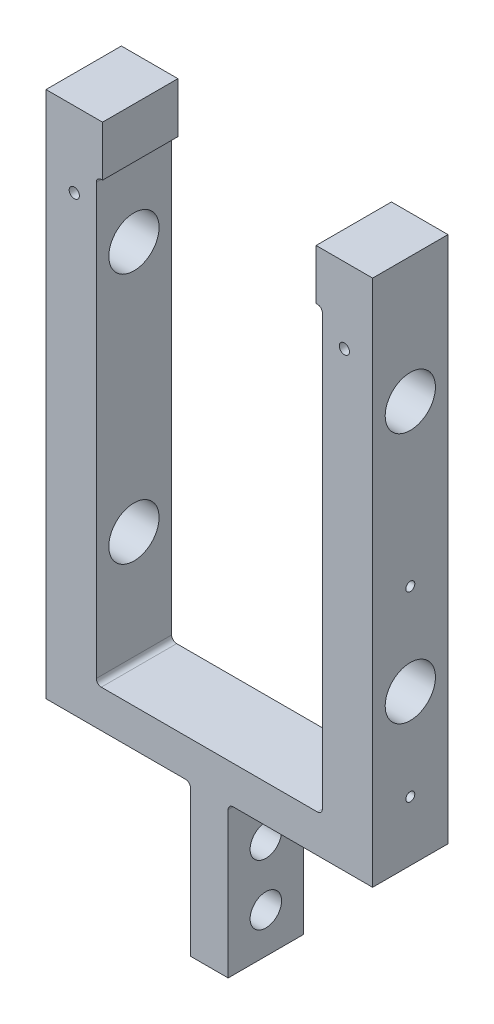
ISO-10303-21;
HEADER;
FILE_DESCRIPTION(('STEP AP214'),'2;1');
FILE_NAME('part.step','',(''),(''),'','','');
FILE_SCHEMA(('AUTOMOTIVE_DESIGN { 1 0 10303 214 1 1 1 1 }'));
ENDSEC;
DATA;
#1=APPLICATION_CONTEXT('core data for automotive mechanical design processes');
#2=APPLICATION_PROTOCOL_DEFINITION('international standard','automotive_design',2000,#1);
#3=PRODUCT_CONTEXT('',#1,'mechanical');
#4=PRODUCT('Part','Part','',(#3));
#5=PRODUCT_RELATED_PRODUCT_CATEGORY('part','',(#4));
#6=PRODUCT_DEFINITION_FORMATION('','',#4);
#7=PRODUCT_DEFINITION_CONTEXT('part definition',#1,'design');
#8=PRODUCT_DEFINITION('design','',#6,#7);
#9=PRODUCT_DEFINITION_SHAPE('','',#8);
#10=(LENGTH_UNIT() NAMED_UNIT(*) SI_UNIT(.MILLI.,.METRE.));
#11=(NAMED_UNIT(*) PLANE_ANGLE_UNIT() SI_UNIT($,.RADIAN.));
#12=(NAMED_UNIT(*) SI_UNIT($,.STERADIAN.) SOLID_ANGLE_UNIT());
#13=UNCERTAINTY_MEASURE_WITH_UNIT(LENGTH_MEASURE(1.E-05),#10,'distance_accuracy_value','');
#14=(GEOMETRIC_REPRESENTATION_CONTEXT(3) GLOBAL_UNCERTAINTY_ASSIGNED_CONTEXT((#13)) GLOBAL_UNIT_ASSIGNED_CONTEXT((#10,
#11,#12)) REPRESENTATION_CONTEXT('',''));
#15=CARTESIAN_POINT('',(0.,0.,0.));
#16=DIRECTION('',(0.,0.,1.));
#17=DIRECTION('',(1.,0.,0.));
#18=AXIS2_PLACEMENT_3D('',#15,#16,#17);
#19=CARTESIAN_POINT('',(41.275,152.4,9.52500000000001));
#20=DIRECTION('',(0.,-1.,0.));
#21=DIRECTION('',(0.,0.,-1.));
#22=AXIS2_PLACEMENT_3D('',#19,#20,#21);
#23=PLANE('',#22);
#24=DIRECTION('',(-1.,0.,0.));
#25=VECTOR('',#24,1.);
#26=CARTESIAN_POINT('',(41.275,152.4,-9.52500000000001));
#27=LINE('',#26,#25);
#28=CARTESIAN_POINT('',(41.275,152.4,-9.52500000000001));
#29=VERTEX_POINT('',#28);
#30=CARTESIAN_POINT('',(26.9875,152.4,-9.52500000000001));
#31=VERTEX_POINT('',#30);
#32=EDGE_CURVE('E275',#29,#31,#27,.T.);
#33=ORIENTED_EDGE('',*,*,#32,.T.);
#34=DIRECTION('',(0.,0.,1.));
#35=VECTOR('',#34,1.);
#36=CARTESIAN_POINT('',(26.9875,152.4,-9.52500000000001));
#37=LINE('',#36,#35);
#38=CARTESIAN_POINT('',(26.9875,152.4,9.52500000000001));
#39=VERTEX_POINT('',#38);
#40=EDGE_CURVE('E258',#31,#39,#37,.T.);
#41=ORIENTED_EDGE('',*,*,#40,.T.);
#42=DIRECTION('',(-1.,0.,0.));
#43=VECTOR('',#42,1.);
#44=CARTESIAN_POINT('',(41.275,152.4,9.52500000000001));
#45=LINE('',#44,#43);
#46=CARTESIAN_POINT('',(41.275,152.4,9.52500000000001));
#47=VERTEX_POINT('',#46);
#48=EDGE_CURVE('E467',#47,#39,#45,.T.);
#49=ORIENTED_EDGE('',*,*,#48,.F.);
#50=DIRECTION('',(0.,0.,-1.));
#51=VECTOR('',#50,1.);
#52=CARTESIAN_POINT('',(41.275,152.4,9.52500000000001));
#53=LINE('',#52,#51);
#54=EDGE_CURVE('E282',#47,#29,#53,.T.);
#55=ORIENTED_EDGE('',*,*,#54,.T.);
#56=EDGE_LOOP('',(#33,#41,#49,#55));
#57=FACE_BOUND('',#56,.T.);
#58=ADVANCED_FACE('F98',(#57),#23,.F.);
#59=CARTESIAN_POINT('',(28.575,139.7,9.52500000000001));
#60=DIRECTION('',(0.,-1.,0.));
#61=DIRECTION('',(0.,0.,-1.));
#62=AXIS2_PLACEMENT_3D('',#59,#60,#61);
#63=PLANE('',#62);
#64=DIRECTION('',(0.,0.,1.));
#65=VECTOR('',#64,1.);
#66=CARTESIAN_POINT('',(26.9875,139.7,-9.52500000000001));
#67=LINE('',#66,#65);
#68=CARTESIAN_POINT('',(26.9875,139.7,-9.52500000000001));
#69=VERTEX_POINT('',#68);
#70=CARTESIAN_POINT('',(26.9875,139.7,9.52500000000001));
#71=VERTEX_POINT('',#70);
#72=EDGE_CURVE('E515',#69,#71,#67,.T.);
#73=ORIENTED_EDGE('',*,*,#72,.F.);
#74=DIRECTION('',(-1.,0.,0.));
#75=VECTOR('',#74,1.);
#76=CARTESIAN_POINT('',(28.575,139.7,-9.52500000000001));
#77=LINE('',#76,#75);
#78=CARTESIAN_POINT('',(27.305,139.7,-9.52500000000001));
#79=VERTEX_POINT('',#78);
#80=EDGE_CURVE('E277',#79,#69,#77,.T.);
#81=ORIENTED_EDGE('',*,*,#80,.F.);
#82=DIRECTION('',(0.,0.,-1.));
#83=VECTOR('',#82,1.);
#84=CARTESIAN_POINT('',(27.305,139.7,9.52500000000001));
#85=LINE('',#84,#83);
#86=CARTESIAN_POINT('',(27.305,139.7,9.52500000000001));
#87=VERTEX_POINT('',#86);
#88=EDGE_CURVE('E374',#79,#87,#85,.F.);
#89=ORIENTED_EDGE('',*,*,#88,.T.);
#90=DIRECTION('',(-1.,0.,0.));
#91=VECTOR('',#90,1.);
#92=CARTESIAN_POINT('',(28.575,139.7,9.52500000000001));
#93=LINE('',#92,#91);
#94=EDGE_CURVE('E436',#87,#71,#93,.T.);
#95=ORIENTED_EDGE('',*,*,#94,.T.);
#96=EDGE_LOOP('',(#73,#81,#89,#95));
#97=FACE_BOUND('',#96,.T.);
#98=ADVANCED_FACE('F514',(#97),#63,.T.);
#99=CARTESIAN_POINT('',(41.275,131.596658993696,9.52500000000001));
#100=DIRECTION('',(-1.,0.,0.));
#101=DIRECTION('',(0.,-1.,0.));
#102=AXIS2_PLACEMENT_3D('',#99,#100,#101);
#103=PLANE('',#102);
#104=CARTESIAN_POINT('',(41.275,80.1624,0.));
#105=DIRECTION('',(1.,0.,0.));
#106=DIRECTION('',(0.,0.,-1.));
#107=AXIS2_PLACEMENT_3D('',#104,#105,#106);
#108=CIRCLE('',#107,1.13029999999999);
#109=CARTESIAN_POINT('',(41.275,80.1624,-1.1303));
#110=VERTEX_POINT('',#109);
#111=EDGE_CURVE('E702',#110,#110,#108,.T.);
#112=ORIENTED_EDGE('',*,*,#111,.F.);
#113=EDGE_LOOP('',(#112));
#114=FACE_BOUND('',#113,.T.);
#115=CARTESIAN_POINT('',(41.275,57.15,0.));
#116=DIRECTION('',(-1.,0.,0.));
#117=DIRECTION('',(0.,-1.,0.));
#118=AXIS2_PLACEMENT_3D('',#115,#116,#117);
#119=CIRCLE('',#118,6.34999999999673);
#120=CARTESIAN_POINT('',(41.275,50.8000000000033,0.));
#121=VERTEX_POINT('',#120);
#122=EDGE_CURVE('E324',#121,#121,#119,.T.);
#123=ORIENTED_EDGE('',*,*,#122,.T.);
#124=EDGE_LOOP('',(#123));
#125=FACE_BOUND('',#124,.T.);
#126=CARTESIAN_POINT('',(41.275,120.65,0.));
#127=DIRECTION('',(-1.,0.,0.));
#128=DIRECTION('',(0.,-1.,0.));
#129=AXIS2_PLACEMENT_3D('',#126,#127,#128);
#130=CIRCLE('',#129,6.34999999999999);
#131=CARTESIAN_POINT('',(41.275,114.3,0.));
#132=VERTEX_POINT('',#131);
#133=EDGE_CURVE('E628',#132,#132,#130,.T.);
#134=ORIENTED_EDGE('',*,*,#133,.T.);
#135=EDGE_LOOP('',(#134));
#136=FACE_BOUND('',#135,.T.);
#137=DIRECTION('',(0.,1.,0.));
#138=VECTOR('',#137,1.);
#139=CARTESIAN_POINT('',(41.275,131.596658993696,-9.52500000000001));
#140=LINE('',#139,#138);
#141=CARTESIAN_POINT('',(41.275,19.05,-9.52500000000001));
#142=VERTEX_POINT('',#141);
#143=EDGE_CURVE('E292',#142,#29,#140,.T.);
#144=ORIENTED_EDGE('',*,*,#143,.T.);
#145=ORIENTED_EDGE('',*,*,#54,.F.);
#146=DIRECTION('',(0.,1.,0.));
#147=VECTOR('',#146,1.);
#148=CARTESIAN_POINT('',(41.275,19.05,9.52500000000001));
#149=LINE('',#148,#147);
#150=CARTESIAN_POINT('',(41.275,19.05,9.52500000000001));
#151=VERTEX_POINT('',#150);
#152=EDGE_CURVE('E463',#151,#47,#149,.T.);
#153=ORIENTED_EDGE('',*,*,#152,.F.);
#154=DIRECTION('',(0.,0.,-1.));
#155=VECTOR('',#154,1.);
#156=CARTESIAN_POINT('',(41.275,19.05,9.52500000000001));
#157=LINE('',#156,#155);
#158=EDGE_CURVE('E314',#151,#142,#157,.T.);
#159=ORIENTED_EDGE('',*,*,#158,.T.);
#160=EDGE_LOOP('',(#144,#145,#153,#159));
#161=FACE_BOUND('',#160,.T.);
#162=CARTESIAN_POINT('',(41.275,34.1376,0.));
#163=DIRECTION('',(1.,0.,0.));
#164=DIRECTION('',(0.,0.,-1.));
#165=AXIS2_PLACEMENT_3D('',#162,#163,#164);
#166=CIRCLE('',#165,1.13029999999999);
#167=CARTESIAN_POINT('',(41.275,34.1376,-1.13029999999999));
#168=VERTEX_POINT('',#167);
#169=EDGE_CURVE('E690',#168,#168,#166,.T.);
#170=ORIENTED_EDGE('',*,*,#169,.F.);
#171=EDGE_LOOP('',(#170));
#172=FACE_BOUND('',#171,.T.);
#173=ADVANCED_FACE('F483',(#114,#125,#136,#161,#172),#103,.F.);
#174=CARTESIAN_POINT('',(28.575,139.7,9.52500000000001));
#175=DIRECTION('',(-1.,0.,0.));
#176=DIRECTION('',(0.,-1.,0.));
#177=AXIS2_PLACEMENT_3D('',#174,#175,#176);
#178=PLANE('',#177);
#179=CARTESIAN_POINT('',(28.575,80.1624,0.));
#180=DIRECTION('',(-1.,0.,0.));
#181=DIRECTION('',(0.,-1.,0.));
#182=AXIS2_PLACEMENT_3D('',#179,#180,#181);
#183=CIRCLE('',#182,1.13029999999999);
#184=CARTESIAN_POINT('',(28.575,79.0321,0.));
#185=VERTEX_POINT('',#184);
#186=EDGE_CURVE('E696',#185,#185,#183,.F.);
#187=ORIENTED_EDGE('',*,*,#186,.T.);
#188=EDGE_LOOP('',(#187));
#189=FACE_BOUND('',#188,.T.);
#190=DIRECTION('',(0.,1.,0.));
#191=VECTOR('',#190,1.);
#192=CARTESIAN_POINT('',(28.575,139.7,-9.52500000000001));
#193=LINE('',#192,#191);
#194=CARTESIAN_POINT('',(28.575,29.845,-9.52500000000001));
#195=VERTEX_POINT('',#194);
#196=CARTESIAN_POINT('',(28.575,138.43,-9.52500000000001));
#197=VERTEX_POINT('',#196);
#198=EDGE_CURVE('E457',#195,#197,#193,.T.);
#199=ORIENTED_EDGE('',*,*,#198,.F.);
#200=DIRECTION('',(0.,0.,-1.));
#201=VECTOR('',#200,1.);
#202=CARTESIAN_POINT('',(28.575,29.845,9.52500000000001));
#203=LINE('',#202,#201);
#204=CARTESIAN_POINT('',(28.575,29.845,9.52500000000001));
#205=VERTEX_POINT('',#204);
#206=EDGE_CURVE('E367',#195,#205,#203,.F.);
#207=ORIENTED_EDGE('',*,*,#206,.T.);
#208=DIRECTION('',(0.,1.,0.));
#209=VECTOR('',#208,1.);
#210=CARTESIAN_POINT('',(28.575,139.7,9.52500000000001));
#211=LINE('',#210,#209);
#212=CARTESIAN_POINT('',(28.575,138.43,9.52500000000001));
#213=VERTEX_POINT('',#212);
#214=EDGE_CURVE('E442',#205,#213,#211,.T.);
#215=ORIENTED_EDGE('',*,*,#214,.T.);
#216=DIRECTION('',(0.,0.,-1.));
#217=VECTOR('',#216,1.);
#218=CARTESIAN_POINT('',(28.575,138.43,-9.52500000000001));
#219=LINE('',#218,#217);
#220=EDGE_CURVE('E363',#213,#197,#219,.T.);
#221=ORIENTED_EDGE('',*,*,#220,.T.);
#222=EDGE_LOOP('',(#199,#207,#215,#221));
#223=FACE_BOUND('',#222,.T.);
#224=CARTESIAN_POINT('',(28.575,120.65,0.));
#225=DIRECTION('',(-1.,0.,0.));
#226=DIRECTION('',(0.,-1.,0.));
#227=AXIS2_PLACEMENT_3D('',#224,#225,#226);
#228=CIRCLE('',#227,6.34999999999999);
#229=CARTESIAN_POINT('',(28.575,114.3,0.));
#230=VERTEX_POINT('',#229);
#231=EDGE_CURVE('E319',#230,#230,#228,.T.);
#232=ORIENTED_EDGE('',*,*,#231,.F.);
#233=EDGE_LOOP('',(#232));
#234=FACE_BOUND('',#233,.T.);
#235=CARTESIAN_POINT('',(28.575,57.15,0.));
#236=DIRECTION('',(-1.,0.,0.));
#237=DIRECTION('',(0.,-1.,0.));
#238=AXIS2_PLACEMENT_3D('',#235,#236,#237);
#239=CIRCLE('',#238,6.34999999999673);
#240=CARTESIAN_POINT('',(28.575,50.8000000000033,0.));
#241=VERTEX_POINT('',#240);
#242=EDGE_CURVE('E325',#241,#241,#239,.T.);
#243=ORIENTED_EDGE('',*,*,#242,.F.);
#244=EDGE_LOOP('',(#243));
#245=FACE_BOUND('',#244,.T.);
#246=CARTESIAN_POINT('',(28.575,34.1376,0.));
#247=DIRECTION('',(-1.,0.,0.));
#248=DIRECTION('',(0.,-1.,0.));
#249=AXIS2_PLACEMENT_3D('',#246,#247,#248);
#250=CIRCLE('',#249,1.13029999999999);
#251=CARTESIAN_POINT('',(28.575,33.0073,0.));
#252=VERTEX_POINT('',#251);
#253=EDGE_CURVE('E501',#252,#252,#250,.F.);
#254=ORIENTED_EDGE('',*,*,#253,.T.);
#255=EDGE_LOOP('',(#254));
#256=FACE_BOUND('',#255,.T.);
#257=ADVANCED_FACE('F524',(#189,#223,#234,#245,#256),#178,.T.);
#258=CARTESIAN_POINT('',(0.,0.,9.52500000000001));
#259=DIRECTION('',(0.,0.,1.));
#260=DIRECTION('',(1.,0.,0.));
#261=AXIS2_PLACEMENT_3D('',#258,#259,#260);
#262=PLANE('',#261);
#263=CARTESIAN_POINT('',(34.13125,133.35,9.52500000000001));
#264=DIRECTION('',(0.,0.,1.));
#265=DIRECTION('',(1.,0.,0.));
#266=AXIS2_PLACEMENT_3D('',#263,#264,#265);
#267=CIRCLE('',#266,1.28904999999999);
#268=CARTESIAN_POINT('',(35.4203,133.35,9.52500000000001));
#269=VERTEX_POINT('',#268);
#270=EDGE_CURVE('E823',#269,#269,#267,.T.);
#271=ORIENTED_EDGE('',*,*,#270,.F.);
#272=EDGE_LOOP('',(#271));
#273=FACE_BOUND('',#272,.T.);
#274=CARTESIAN_POINT('',(-34.13125,133.35,9.52500000000001));
#275=DIRECTION('',(0.,0.,1.));
#276=DIRECTION('',(1.,0.,0.));
#277=AXIS2_PLACEMENT_3D('',#274,#275,#276);
#278=CIRCLE('',#277,1.28904999999999);
#279=CARTESIAN_POINT('',(-32.8422,133.35,9.52500000000001));
#280=VERTEX_POINT('',#279);
#281=EDGE_CURVE('E815',#280,#280,#278,.T.);
#282=ORIENTED_EDGE('',*,*,#281,.F.);
#283=EDGE_LOOP('',(#282));
#284=FACE_BOUND('',#283,.T.);
#285=DIRECTION('',(0.,1.,0.));
#286=VECTOR('',#285,1.);
#287=CARTESIAN_POINT('',(26.9875,152.4,9.52500000000001));
#288=LINE('',#287,#286);
#289=EDGE_CURVE('E261',#71,#39,#288,.T.);
#290=ORIENTED_EDGE('',*,*,#289,.F.);
#291=ORIENTED_EDGE('',*,*,#94,.F.);
#292=CARTESIAN_POINT('',(27.305,138.43,9.52500000000001));
#293=DIRECTION('',(0.,0.,1.));
#294=DIRECTION('',(1.,0.,0.));
#295=AXIS2_PLACEMENT_3D('',#292,#293,#294);
#296=CIRCLE('',#295,1.27);
#297=EDGE_CURVE('E404',#87,#213,#296,.F.);
#298=ORIENTED_EDGE('',*,*,#297,.T.);
#299=ORIENTED_EDGE('',*,*,#214,.F.);
#300=CARTESIAN_POINT('',(27.305,29.845,9.52500000000001));
#301=DIRECTION('',(0.,0.,1.));
#302=DIRECTION('',(1.,0.,0.));
#303=AXIS2_PLACEMENT_3D('',#300,#301,#302);
#304=CIRCLE('',#303,1.27);
#305=CARTESIAN_POINT('',(27.305,28.575,9.52500000000001));
#306=VERTEX_POINT('',#305);
#307=EDGE_CURVE('E398',#205,#306,#304,.F.);
#308=ORIENTED_EDGE('',*,*,#307,.T.);
#309=DIRECTION('',(1.,0.,0.));
#310=VECTOR('',#309,1.);
#311=CARTESIAN_POINT('',(-28.575,28.575,9.52500000000001));
#312=LINE('',#311,#310);
#313=CARTESIAN_POINT('',(-27.305,28.575,9.52500000000001));
#314=VERTEX_POINT('',#313);
#315=EDGE_CURVE('E435',#314,#306,#312,.T.);
#316=ORIENTED_EDGE('',*,*,#315,.F.);
#317=CARTESIAN_POINT('',(-27.305,29.845,9.52500000000001));
#318=DIRECTION('',(0.,0.,1.));
#319=DIRECTION('',(1.,0.,0.));
#320=AXIS2_PLACEMENT_3D('',#317,#318,#319);
#321=CIRCLE('',#320,1.27);
#322=CARTESIAN_POINT('',(-28.575,29.845,9.52500000000001));
#323=VERTEX_POINT('',#322);
#324=EDGE_CURVE('E392',#314,#323,#321,.F.);
#325=ORIENTED_EDGE('',*,*,#324,.T.);
#326=DIRECTION('',(0.,-1.,0.));
#327=VECTOR('',#326,1.);
#328=CARTESIAN_POINT('',(-28.575,139.7,9.52500000000001));
#329=LINE('',#328,#327);
#330=CARTESIAN_POINT('',(-28.575,138.43,9.52500000000001));
#331=VERTEX_POINT('',#330);
#332=EDGE_CURVE('E431',#331,#323,#329,.T.);
#333=ORIENTED_EDGE('',*,*,#332,.F.);
#334=CARTESIAN_POINT('',(-27.305,138.43,9.52500000000001));
#335=DIRECTION('',(0.,0.,1.));
#336=DIRECTION('',(1.,0.,0.));
#337=AXIS2_PLACEMENT_3D('',#334,#335,#336);
#338=CIRCLE('',#337,1.27);
#339=CARTESIAN_POINT('',(-27.305,139.7,9.52500000000001));
#340=VERTEX_POINT('',#339);
#341=EDGE_CURVE('E12',#331,#340,#338,.F.);
#342=ORIENTED_EDGE('',*,*,#341,.T.);
#343=CARTESIAN_POINT('',(-26.9875,139.7,9.52500000000001));
#344=VERTEX_POINT('',#343);
#345=EDGE_CURVE('E430',#344,#340,#93,.T.);
#346=ORIENTED_EDGE('',*,*,#345,.F.);
#347=DIRECTION('',(0.,-1.,0.));
#348=VECTOR('',#347,1.);
#349=CARTESIAN_POINT('',(-26.9875,152.4,9.52500000000001));
#350=LINE('',#349,#348);
#351=CARTESIAN_POINT('',(-26.9875,152.4,9.52500000000001));
#352=VERTEX_POINT('',#351);
#353=EDGE_CURVE('E114',#352,#344,#350,.T.);
#354=ORIENTED_EDGE('',*,*,#353,.F.);
#355=CARTESIAN_POINT('',(-41.275,152.4,9.52500000000001));
#356=VERTEX_POINT('',#355);
#357=EDGE_CURVE('E466',#352,#356,#45,.T.);
#358=ORIENTED_EDGE('',*,*,#357,.T.);
#359=DIRECTION('',(0.,-1.,0.));
#360=VECTOR('',#359,1.);
#361=CARTESIAN_POINT('',(-41.275,152.4,9.52500000000001));
#362=LINE('',#361,#360);
#363=CARTESIAN_POINT('',(-41.275,19.05,9.52500000000001));
#364=VERTEX_POINT('',#363);
#365=EDGE_CURVE('E470',#356,#364,#362,.T.);
#366=ORIENTED_EDGE('',*,*,#365,.T.);
#367=DIRECTION('',(1.,0.,0.));
#368=VECTOR('',#367,1.);
#369=CARTESIAN_POINT('',(-9.525,19.05,9.52500000000001));
#370=LINE('',#369,#368);
#371=CARTESIAN_POINT('',(-9.525,19.05,9.52500000000001));
#372=VERTEX_POINT('',#371);
#373=EDGE_CURVE('E304',#364,#372,#370,.T.);
#374=ORIENTED_EDGE('',*,*,#373,.T.);
#375=DIRECTION('',(0.,1.,0.));
#376=VECTOR('',#375,1.);
#377=CARTESIAN_POINT('',(-9.525,19.0579297952041,9.52500000000001));
#378=LINE('',#377,#376);
#379=CARTESIAN_POINT('',(-9.525,19.0579297952041,9.52500000000001));
#380=VERTEX_POINT('',#379);
#381=EDGE_CURVE('E657',#372,#380,#378,.T.);
#382=ORIENTED_EDGE('',*,*,#381,.T.);
#383=DIRECTION('',(1.,0.,0.));
#384=VECTOR('',#383,1.);
#385=CARTESIAN_POINT('',(-4.7625,19.0579297952041,9.52500000000001));
#386=LINE('',#385,#384);
#387=CARTESIAN_POINT('',(-6.0325,19.0579297952041,9.52500000000001));
#388=VERTEX_POINT('',#387);
#389=EDGE_CURVE('E651',#380,#388,#386,.T.);
#390=ORIENTED_EDGE('',*,*,#389,.T.);
#391=CARTESIAN_POINT('',(-6.0325,17.7879297952041,9.52500000000001));
#392=DIRECTION('',(0.,0.,1.));
#393=DIRECTION('',(1.,0.,0.));
#394=AXIS2_PLACEMENT_3D('',#391,#392,#393);
#395=CIRCLE('',#394,1.27);
#396=CARTESIAN_POINT('',(-4.7625,17.7879297952041,9.52500000000001));
#397=VERTEX_POINT('',#396);
#398=EDGE_CURVE('E386',#388,#397,#395,.F.);
#399=ORIENTED_EDGE('',*,*,#398,.T.);
#400=DIRECTION('',(0.,-1.,0.));
#401=VECTOR('',#400,1.);
#402=CARTESIAN_POINT('',(-4.7625,19.0579297952041,9.52500000000001));
#403=LINE('',#402,#401);
#404=CARTESIAN_POINT('',(-4.7625,-19.05,9.52500000000001));
#405=VERTEX_POINT('',#404);
#406=EDGE_CURVE('E646',#397,#405,#403,.T.);
#407=ORIENTED_EDGE('',*,*,#406,.T.);
#408=DIRECTION('',(-1.,0.,0.));
#409=VECTOR('',#408,1.);
#410=CARTESIAN_POINT('',(4.7625,-19.05,9.52500000000001));
#411=LINE('',#410,#409);
#412=CARTESIAN_POINT('',(4.7625,-19.05,9.52500000000001));
#413=VERTEX_POINT('',#412);
#414=EDGE_CURVE('E719',#413,#405,#411,.T.);
#415=ORIENTED_EDGE('',*,*,#414,.F.);
#416=DIRECTION('',(0.,1.,0.));
#417=VECTOR('',#416,1.);
#418=CARTESIAN_POINT('',(4.7625,19.05,9.52500000000001));
#419=LINE('',#418,#417);
#420=CARTESIAN_POINT('',(4.7625,17.78,9.52500000000001));
#421=VERTEX_POINT('',#420);
#422=EDGE_CURVE('E500',#413,#421,#419,.T.);
#423=ORIENTED_EDGE('',*,*,#422,.T.);
#424=CARTESIAN_POINT('',(6.0325,17.78,9.52500000000001));
#425=DIRECTION('',(0.,0.,1.));
#426=DIRECTION('',(1.,0.,0.));
#427=AXIS2_PLACEMENT_3D('',#424,#425,#426);
#428=CIRCLE('',#427,1.27);
#429=CARTESIAN_POINT('',(6.0325,19.05,9.52500000000001));
#430=VERTEX_POINT('',#429);
#431=EDGE_CURVE('E380',#421,#430,#428,.F.);
#432=ORIENTED_EDGE('',*,*,#431,.T.);
#433=DIRECTION('',(1.,0.,0.));
#434=VECTOR('',#433,1.);
#435=CARTESIAN_POINT('',(9.525,19.05,9.52500000000001));
#436=LINE('',#435,#434);
#437=EDGE_CURVE('E299',#430,#151,#436,.T.);
#438=ORIENTED_EDGE('',*,*,#437,.T.);
#439=ORIENTED_EDGE('',*,*,#152,.T.);
#440=ORIENTED_EDGE('',*,*,#48,.T.);
#441=EDGE_LOOP('',(#290,#291,#298,#299,#308,#316,#325,#333,#342,#346,#354,#358,#366,#374,#382,
#390,#399,#407,#415,#423,#432,#438,#439,#440));
#442=FACE_BOUND('',#441,.T.);
#443=ADVANCED_FACE('F429',(#273,#284,#442),#262,.T.);
#444=CARTESIAN_POINT('',(0.,0.,-9.52500000000001));
#445=DIRECTION('',(0.,0.,1.));
#446=DIRECTION('',(1.,0.,0.));
#447=AXIS2_PLACEMENT_3D('',#444,#445,#446);
#448=PLANE('',#447);
#449=CARTESIAN_POINT('',(34.13125,133.35,-9.52500000000001));
#450=DIRECTION('',(0.,0.,1.));
#451=DIRECTION('',(1.,0.,0.));
#452=AXIS2_PLACEMENT_3D('',#449,#450,#451);
#453=CIRCLE('',#452,1.28904999999999);
#454=CARTESIAN_POINT('',(35.4203,133.35,-9.52500000000001));
#455=VERTEX_POINT('',#454);
#456=EDGE_CURVE('E819',#455,#455,#453,.T.);
#457=ORIENTED_EDGE('',*,*,#456,.T.);
#458=EDGE_LOOP('',(#457));
#459=FACE_BOUND('',#458,.T.);
#460=CARTESIAN_POINT('',(-34.13125,133.35,-9.52500000000001));
#461=DIRECTION('',(0.,0.,1.));
#462=DIRECTION('',(1.,0.,0.));
#463=AXIS2_PLACEMENT_3D('',#460,#461,#462);
#464=CIRCLE('',#463,1.28904999999999);
#465=CARTESIAN_POINT('',(-32.8422,133.35,-9.52500000000001));
#466=VERTEX_POINT('',#465);
#467=EDGE_CURVE('E511',#466,#466,#464,.T.);
#468=ORIENTED_EDGE('',*,*,#467,.T.);
#469=EDGE_LOOP('',(#468));
#470=FACE_BOUND('',#469,.T.);
#471=ORIENTED_EDGE('',*,*,#80,.T.);
#472=DIRECTION('',(0.,1.,0.));
#473=VECTOR('',#472,1.);
#474=CARTESIAN_POINT('',(26.9875,152.4,-9.52500000000001));
#475=LINE('',#474,#473);
#476=EDGE_CURVE('E122',#69,#31,#475,.T.);
#477=ORIENTED_EDGE('',*,*,#476,.T.);
#478=ORIENTED_EDGE('',*,*,#32,.F.);
#479=ORIENTED_EDGE('',*,*,#143,.F.);
#480=DIRECTION('',(1.,0.,0.));
#481=VECTOR('',#480,1.);
#482=CARTESIAN_POINT('',(9.525,19.05,-9.52500000000001));
#483=LINE('',#482,#481);
#484=CARTESIAN_POINT('',(6.0325,19.05,-9.52500000000001));
#485=VERTEX_POINT('',#484);
#486=EDGE_CURVE('E451',#485,#142,#483,.T.);
#487=ORIENTED_EDGE('',*,*,#486,.F.);
#488=CARTESIAN_POINT('',(6.0325,17.78,-9.52500000000001));
#489=DIRECTION('',(0.,0.,1.));
#490=DIRECTION('',(1.,0.,0.));
#491=AXIS2_PLACEMENT_3D('',#488,#489,#490);
#492=CIRCLE('',#491,1.27);
#493=CARTESIAN_POINT('',(4.7625,17.78,-9.52500000000001));
#494=VERTEX_POINT('',#493);
#495=EDGE_CURVE('E377',#485,#494,#492,.T.);
#496=ORIENTED_EDGE('',*,*,#495,.T.);
#497=DIRECTION('',(0.,1.,0.));
#498=VECTOR('',#497,1.);
#499=CARTESIAN_POINT('',(4.7625,19.05,-9.52500000000001));
#500=LINE('',#499,#498);
#501=CARTESIAN_POINT('',(4.7625,-19.05,-9.52500000000001));
#502=VERTEX_POINT('',#501);
#503=EDGE_CURVE('E488',#502,#494,#500,.T.);
#504=ORIENTED_EDGE('',*,*,#503,.F.);
#505=DIRECTION('',(1.,0.,0.));
#506=VECTOR('',#505,1.);
#507=CARTESIAN_POINT('',(4.7625,-19.05,-9.52500000000001));
#508=LINE('',#507,#506);
#509=CARTESIAN_POINT('',(-4.7625,-19.05,-9.52500000000001));
#510=VERTEX_POINT('',#509);
#511=EDGE_CURVE('E708',#510,#502,#508,.T.);
#512=ORIENTED_EDGE('',*,*,#511,.F.);
#513=DIRECTION('',(0.,-1.,0.));
#514=VECTOR('',#513,1.);
#515=CARTESIAN_POINT('',(-4.7625,19.0579297952041,-9.52500000000001));
#516=LINE('',#515,#514);
#517=CARTESIAN_POINT('',(-4.7625,17.7879297952041,-9.52500000000001));
#518=VERTEX_POINT('',#517);
#519=EDGE_CURVE('E663',#518,#510,#516,.T.);
#520=ORIENTED_EDGE('',*,*,#519,.F.);
#521=CARTESIAN_POINT('',(-6.0325,17.7879297952041,-9.52500000000001));
#522=DIRECTION('',(0.,0.,1.));
#523=DIRECTION('',(1.,0.,0.));
#524=AXIS2_PLACEMENT_3D('',#521,#522,#523);
#525=CIRCLE('',#524,1.27);
#526=CARTESIAN_POINT('',(-6.0325,19.0579297952041,-9.52500000000001));
#527=VERTEX_POINT('',#526);
#528=EDGE_CURVE('E383',#518,#527,#525,.T.);
#529=ORIENTED_EDGE('',*,*,#528,.T.);
#530=DIRECTION('',(1.,0.,0.));
#531=VECTOR('',#530,1.);
#532=CARTESIAN_POINT('',(-4.7625,19.0579297952041,-9.52500000000001));
#533=LINE('',#532,#531);
#534=CARTESIAN_POINT('',(-9.525,19.0579297952041,-9.52500000000001));
#535=VERTEX_POINT('',#534);
#536=EDGE_CURVE('E668',#535,#527,#533,.T.);
#537=ORIENTED_EDGE('',*,*,#536,.F.);
#538=DIRECTION('',(0.,1.,0.));
#539=VECTOR('',#538,1.);
#540=CARTESIAN_POINT('',(-9.525,19.0579297952041,-9.52500000000001));
#541=LINE('',#540,#539);
#542=CARTESIAN_POINT('',(-9.525,19.05,-9.52500000000001));
#543=VERTEX_POINT('',#542);
#544=EDGE_CURVE('E674',#543,#535,#541,.T.);
#545=ORIENTED_EDGE('',*,*,#544,.F.);
#546=DIRECTION('',(1.,0.,0.));
#547=VECTOR('',#546,1.);
#548=CARTESIAN_POINT('',(-9.525,19.05,-9.52500000000001));
#549=LINE('',#548,#547);
#550=CARTESIAN_POINT('',(-41.275,19.05,-9.52500000000001));
#551=VERTEX_POINT('',#550);
#552=EDGE_CURVE('E290',#551,#543,#549,.T.);
#553=ORIENTED_EDGE('',*,*,#552,.F.);
#554=DIRECTION('',(0.,-1.,0.));
#555=VECTOR('',#554,1.);
#556=CARTESIAN_POINT('',(-41.275,19.05,-9.52500000000001));
#557=LINE('',#556,#555);
#558=CARTESIAN_POINT('',(-41.275,152.4,-9.52500000000001));
#559=VERTEX_POINT('',#558);
#560=EDGE_CURVE('E284',#559,#551,#557,.T.);
#561=ORIENTED_EDGE('',*,*,#560,.F.);
#562=CARTESIAN_POINT('',(-26.9875,152.4,-9.52500000000001));
#563=VERTEX_POINT('',#562);
#564=EDGE_CURVE('E285',#563,#559,#27,.T.);
#565=ORIENTED_EDGE('',*,*,#564,.F.);
#566=DIRECTION('',(0.,-1.,0.));
#567=VECTOR('',#566,1.);
#568=CARTESIAN_POINT('',(-26.9875,152.4,-9.52500000000001));
#569=LINE('',#568,#567);
#570=CARTESIAN_POINT('',(-26.9875,139.7,-9.52500000000001));
#571=VERTEX_POINT('',#570);
#572=EDGE_CURVE('E268',#563,#571,#569,.T.);
#573=ORIENTED_EDGE('',*,*,#572,.T.);
#574=CARTESIAN_POINT('',(-27.305,139.7,-9.52500000000001));
#575=VERTEX_POINT('',#574);
#576=EDGE_CURVE('E414',#571,#575,#77,.T.);
#577=ORIENTED_EDGE('',*,*,#576,.T.);
#578=CARTESIAN_POINT('',(-27.305,138.43,-9.52500000000001));
#579=DIRECTION('',(0.,0.,1.));
#580=DIRECTION('',(1.,0.,0.));
#581=AXIS2_PLACEMENT_3D('',#578,#579,#580);
#582=CIRCLE('',#581,1.27);
#583=CARTESIAN_POINT('',(-28.575,138.43,-9.52500000000001));
#584=VERTEX_POINT('',#583);
#585=EDGE_CURVE('E107',#575,#584,#582,.T.);
#586=ORIENTED_EDGE('',*,*,#585,.T.);
#587=DIRECTION('',(0.,-1.,0.));
#588=VECTOR('',#587,1.);
#589=CARTESIAN_POINT('',(-28.575,139.7,-9.52500000000001));
#590=LINE('',#589,#588);
#591=CARTESIAN_POINT('',(-28.575,29.845,-9.52500000000001));
#592=VERTEX_POINT('',#591);
#593=EDGE_CURVE('E411',#584,#592,#590,.T.);
#594=ORIENTED_EDGE('',*,*,#593,.T.);
#595=CARTESIAN_POINT('',(-27.305,29.845,-9.52500000000001));
#596=DIRECTION('',(0.,0.,1.));
#597=DIRECTION('',(1.,0.,0.));
#598=AXIS2_PLACEMENT_3D('',#595,#596,#597);
#599=CIRCLE('',#598,1.27);
#600=CARTESIAN_POINT('',(-27.305,28.575,-9.52500000000001));
#601=VERTEX_POINT('',#600);
#602=EDGE_CURVE('E389',#592,#601,#599,.T.);
#603=ORIENTED_EDGE('',*,*,#602,.T.);
#604=DIRECTION('',(1.,0.,0.));
#605=VECTOR('',#604,1.);
#606=CARTESIAN_POINT('',(-28.575,28.575,-9.52500000000001));
#607=LINE('',#606,#605);
#608=CARTESIAN_POINT('',(27.305,28.575,-9.52500000000001));
#609=VERTEX_POINT('',#608);
#610=EDGE_CURVE('E424',#601,#609,#607,.T.);
#611=ORIENTED_EDGE('',*,*,#610,.T.);
#612=CARTESIAN_POINT('',(27.305,29.845,-9.52500000000001));
#613=DIRECTION('',(0.,0.,1.));
#614=DIRECTION('',(1.,0.,0.));
#615=AXIS2_PLACEMENT_3D('',#612,#613,#614);
#616=CIRCLE('',#615,1.27);
#617=EDGE_CURVE('E395',#609,#195,#616,.T.);
#618=ORIENTED_EDGE('',*,*,#617,.T.);
#619=ORIENTED_EDGE('',*,*,#198,.T.);
#620=CARTESIAN_POINT('',(27.305,138.43,-9.52500000000001));
#621=DIRECTION('',(0.,0.,1.));
#622=DIRECTION('',(1.,0.,0.));
#623=AXIS2_PLACEMENT_3D('',#620,#621,#622);
#624=CIRCLE('',#623,1.27);
#625=EDGE_CURVE('E401',#197,#79,#624,.T.);
#626=ORIENTED_EDGE('',*,*,#625,.T.);
#627=EDGE_LOOP('',(#471,#477,#478,#479,#487,#496,#504,#512,#520,#529,#537,#545,#553,#561,#565,
#573,#577,#586,#594,#603,#611,#618,#619,#626));
#628=FACE_BOUND('',#627,.T.);
#629=ADVANCED_FACE('F273',(#459,#470,#628),#448,.F.);
#630=CARTESIAN_POINT('',(9.525,19.05,9.52500000000001));
#631=DIRECTION('',(0.,1.,0.));
#632=DIRECTION('',(-1.,0.,0.));
#633=AXIS2_PLACEMENT_3D('',#630,#631,#632);
#634=PLANE('',#633);
#635=ORIENTED_EDGE('',*,*,#437,.F.);
#636=DIRECTION('',(0.,0.,-1.));
#637=VECTOR('',#636,1.);
#638=CARTESIAN_POINT('',(6.0325,19.05,-9.52500000000001));
#639=LINE('',#638,#637);
#640=EDGE_CURVE('E318',#430,#485,#639,.T.);
#641=ORIENTED_EDGE('',*,*,#640,.T.);
#642=ORIENTED_EDGE('',*,*,#486,.T.);
#643=ORIENTED_EDGE('',*,*,#158,.F.);
#644=EDGE_LOOP('',(#635,#641,#642,#643));
#645=FACE_BOUND('',#644,.T.);
#646=ADVANCED_FACE('F507',(#645),#634,.F.);
#647=ORIENTED_EDGE('',*,*,#357,.F.);
#648=DIRECTION('',(0.,0.,1.));
#649=VECTOR('',#648,1.);
#650=CARTESIAN_POINT('',(-26.9875,152.4,-9.52500000000001));
#651=LINE('',#650,#649);
#652=EDGE_CURVE('E267',#563,#352,#651,.T.);
#653=ORIENTED_EDGE('',*,*,#652,.F.);
#654=ORIENTED_EDGE('',*,*,#564,.T.);
#655=DIRECTION('',(0.,0.,-1.));
#656=VECTOR('',#655,1.);
#657=CARTESIAN_POINT('',(-41.275,152.4,9.52500000000001));
#658=LINE('',#657,#656);
#659=EDGE_CURVE('E308',#356,#559,#658,.T.);
#660=ORIENTED_EDGE('',*,*,#659,.F.);
#661=EDGE_LOOP('',(#647,#653,#654,#660));
#662=FACE_BOUND('',#661,.T.);
#663=ADVANCED_FACE('F548',(#662),#23,.F.);
#664=CARTESIAN_POINT('',(-41.275,19.05,9.52500000000001));
#665=DIRECTION('',(1.,0.,0.));
#666=DIRECTION('',(0.,1.,0.));
#667=AXIS2_PLACEMENT_3D('',#664,#665,#666);
#668=PLANE('',#667);
#669=CARTESIAN_POINT('',(-41.275,57.15,0.));
#670=DIRECTION('',(-1.,0.,0.));
#671=DIRECTION('',(0.,-1.,0.));
#672=AXIS2_PLACEMENT_3D('',#669,#670,#671);
#673=CIRCLE('',#672,6.34999999999673);
#674=CARTESIAN_POINT('',(-41.275,50.8000000000033,0.));
#675=VERTEX_POINT('',#674);
#676=EDGE_CURVE('E622',#675,#675,#673,.T.);
#677=ORIENTED_EDGE('',*,*,#676,.F.);
#678=EDGE_LOOP('',(#677));
#679=FACE_BOUND('',#678,.T.);
#680=CARTESIAN_POINT('',(-41.275,120.65,0.));
#681=DIRECTION('',(-1.,0.,0.));
#682=DIRECTION('',(0.,-1.,0.));
#683=AXIS2_PLACEMENT_3D('',#680,#681,#682);
#684=CIRCLE('',#683,6.34999999999999);
#685=CARTESIAN_POINT('',(-41.275,114.3,0.));
#686=VERTEX_POINT('',#685);
#687=EDGE_CURVE('E634',#686,#686,#684,.T.);
#688=ORIENTED_EDGE('',*,*,#687,.F.);
#689=EDGE_LOOP('',(#688));
#690=FACE_BOUND('',#689,.T.);
#691=ORIENTED_EDGE('',*,*,#560,.T.);
#692=DIRECTION('',(0.,0.,-1.));
#693=VECTOR('',#692,1.);
#694=CARTESIAN_POINT('',(-41.275,19.05,9.52500000000001));
#695=LINE('',#694,#693);
#696=EDGE_CURVE('E303',#364,#551,#695,.T.);
#697=ORIENTED_EDGE('',*,*,#696,.F.);
#698=ORIENTED_EDGE('',*,*,#365,.F.);
#699=ORIENTED_EDGE('',*,*,#659,.T.);
#700=EDGE_LOOP('',(#691,#697,#698,#699));
#701=FACE_BOUND('',#700,.T.);
#702=ADVANCED_FACE('F557',(#679,#690,#701),#668,.F.);
#703=CARTESIAN_POINT('',(-9.525,19.05,9.52500000000001));
#704=DIRECTION('',(0.,1.,0.));
#705=DIRECTION('',(-1.,0.,0.));
#706=AXIS2_PLACEMENT_3D('',#703,#704,#705);
#707=PLANE('',#706);
#708=ORIENTED_EDGE('',*,*,#552,.T.);
#709=DIRECTION('',(0.,0.,-1.));
#710=VECTOR('',#709,1.);
#711=CARTESIAN_POINT('',(-9.525,19.05,9.52500000000001));
#712=LINE('',#711,#710);
#713=EDGE_CURVE('E300',#372,#543,#712,.T.);
#714=ORIENTED_EDGE('',*,*,#713,.F.);
#715=ORIENTED_EDGE('',*,*,#373,.F.);
#716=ORIENTED_EDGE('',*,*,#696,.T.);
#717=EDGE_LOOP('',(#708,#714,#715,#716));
#718=FACE_BOUND('',#717,.T.);
#719=ADVANCED_FACE('F563',(#718),#707,.F.);
#720=DIRECTION('',(0.,0.,1.));
#721=VECTOR('',#720,1.);
#722=CARTESIAN_POINT('',(-26.9875,139.7,-9.52500000000001));
#723=LINE('',#722,#721);
#724=EDGE_CURVE('E801',#571,#344,#723,.T.);
#725=ORIENTED_EDGE('',*,*,#724,.T.);
#726=ORIENTED_EDGE('',*,*,#345,.T.);
#727=DIRECTION('',(0.,0.,-1.));
#728=VECTOR('',#727,1.);
#729=CARTESIAN_POINT('',(-27.305,139.7,-9.52500000000001));
#730=LINE('',#729,#728);
#731=EDGE_CURVE('E370',#340,#575,#730,.T.);
#732=ORIENTED_EDGE('',*,*,#731,.T.);
#733=ORIENTED_EDGE('',*,*,#576,.F.);
#734=EDGE_LOOP('',(#725,#726,#732,#733));
#735=FACE_BOUND('',#734,.T.);
#736=ADVANCED_FACE('F553',(#735),#63,.T.);
#737=CARTESIAN_POINT('',(-28.575,139.7,9.52500000000001));
#738=DIRECTION('',(1.,0.,0.));
#739=DIRECTION('',(0.,1.,0.));
#740=AXIS2_PLACEMENT_3D('',#737,#738,#739);
#741=PLANE('',#740);
#742=CARTESIAN_POINT('',(-28.575,57.15,0.));
#743=DIRECTION('',(1.,0.,0.));
#744=DIRECTION('',(0.,1.,0.));
#745=AXIS2_PLACEMENT_3D('',#742,#743,#744);
#746=CIRCLE('',#745,6.34999999999673);
#747=CARTESIAN_POINT('',(-28.575,63.4999999999967,0.));
#748=VERTEX_POINT('',#747);
#749=EDGE_CURVE('E329',#748,#748,#746,.T.);
#750=ORIENTED_EDGE('',*,*,#749,.F.);
#751=EDGE_LOOP('',(#750));
#752=FACE_BOUND('',#751,.T.);
#753=CARTESIAN_POINT('',(-28.575,120.65,0.));
#754=DIRECTION('',(1.,0.,0.));
#755=DIRECTION('',(0.,1.,0.));
#756=AXIS2_PLACEMENT_3D('',#753,#754,#755);
#757=CIRCLE('',#756,6.34999999999999);
#758=CARTESIAN_POINT('',(-28.575,127.,0.));
#759=VERTEX_POINT('',#758);
#760=EDGE_CURVE('E323',#759,#759,#757,.T.);
#761=ORIENTED_EDGE('',*,*,#760,.F.);
#762=EDGE_LOOP('',(#761));
#763=FACE_BOUND('',#762,.T.);
#764=ORIENTED_EDGE('',*,*,#332,.T.);
#765=DIRECTION('',(0.,0.,-1.));
#766=VECTOR('',#765,1.);
#767=CARTESIAN_POINT('',(-28.575,29.845,-9.52500000000001));
#768=LINE('',#767,#766);
#769=EDGE_CURVE('E352',#323,#592,#768,.T.);
#770=ORIENTED_EDGE('',*,*,#769,.T.);
#771=ORIENTED_EDGE('',*,*,#593,.F.);
#772=DIRECTION('',(0.,0.,-1.));
#773=VECTOR('',#772,1.);
#774=CARTESIAN_POINT('',(-28.575,138.43,9.52500000000001));
#775=LINE('',#774,#773);
#776=EDGE_CURVE('E349',#584,#331,#775,.F.);
#777=ORIENTED_EDGE('',*,*,#776,.T.);
#778=EDGE_LOOP('',(#764,#770,#771,#777));
#779=FACE_BOUND('',#778,.T.);
#780=ADVANCED_FACE('F420',(#752,#763,#779),#741,.T.);
#781=CARTESIAN_POINT('',(-28.575,28.575,9.52500000000001));
#782=DIRECTION('',(0.,1.,0.));
#783=DIRECTION('',(-1.,0.,0.));
#784=AXIS2_PLACEMENT_3D('',#781,#782,#783);
#785=PLANE('',#784);
#786=ORIENTED_EDGE('',*,*,#610,.F.);
#787=DIRECTION('',(0.,0.,-1.));
#788=VECTOR('',#787,1.);
#789=CARTESIAN_POINT('',(-27.305,28.575,9.52500000000001));
#790=LINE('',#789,#788);
#791=EDGE_CURVE('E360',#601,#314,#790,.F.);
#792=ORIENTED_EDGE('',*,*,#791,.T.);
#793=ORIENTED_EDGE('',*,*,#315,.T.);
#794=DIRECTION('',(0.,0.,-1.));
#795=VECTOR('',#794,1.);
#796=CARTESIAN_POINT('',(27.305,28.575,-9.52500000000001));
#797=LINE('',#796,#795);
#798=EDGE_CURVE('E356',#306,#609,#797,.T.);
#799=ORIENTED_EDGE('',*,*,#798,.T.);
#800=EDGE_LOOP('',(#786,#792,#793,#799));
#801=FACE_BOUND('',#800,.T.);
#802=ADVANCED_FACE('F532',(#801),#785,.T.);
#803=CARTESIAN_POINT('',(41.275,120.65,0.));
#804=DIRECTION('',(-1.,0.,0.));
#805=DIRECTION('',(0.,-1.,0.));
#806=AXIS2_PLACEMENT_3D('',#803,#804,#805);
#807=CYLINDRICAL_SURFACE('',#806,6.34999999999999);
#808=ORIENTED_EDGE('',*,*,#231,.T.);
#809=EDGE_LOOP('',(#808));
#810=FACE_BOUND('',#809,.T.);
#811=ORIENTED_EDGE('',*,*,#133,.F.);
#812=EDGE_LOOP('',(#811));
#813=FACE_BOUND('',#812,.T.);
#814=ADVANCED_FACE('F891',(#810,#813),#807,.F.);
#815=CARTESIAN_POINT('',(41.275,57.15,0.));
#816=DIRECTION('',(-1.,0.,0.));
#817=DIRECTION('',(0.,-1.,0.));
#818=AXIS2_PLACEMENT_3D('',#815,#816,#817);
#819=CYLINDRICAL_SURFACE('',#818,6.34999999999673);
#820=ORIENTED_EDGE('',*,*,#242,.T.);
#821=EDGE_LOOP('',(#820));
#822=FACE_BOUND('',#821,.T.);
#823=ORIENTED_EDGE('',*,*,#122,.F.);
#824=EDGE_LOOP('',(#823));
#825=FACE_BOUND('',#824,.T.);
#826=ADVANCED_FACE('F887',(#822,#825),#819,.F.);
#827=ORIENTED_EDGE('',*,*,#760,.T.);
#828=EDGE_LOOP('',(#827));
#829=FACE_BOUND('',#828,.T.);
#830=ORIENTED_EDGE('',*,*,#687,.T.);
#831=EDGE_LOOP('',(#830));
#832=FACE_BOUND('',#831,.T.);
#833=ADVANCED_FACE('F890',(#829,#832),#807,.F.);
#834=ORIENTED_EDGE('',*,*,#749,.T.);
#835=EDGE_LOOP('',(#834));
#836=FACE_BOUND('',#835,.T.);
#837=ORIENTED_EDGE('',*,*,#676,.T.);
#838=EDGE_LOOP('',(#837));
#839=FACE_BOUND('',#838,.T.);
#840=ADVANCED_FACE('F882',(#836,#839),#819,.F.);
#841=CARTESIAN_POINT('',(-9.525,19.0579297952041,9.52500000000001));
#842=DIRECTION('',(-1.,0.,0.));
#843=DIRECTION('',(0.,0.,1.));
#844=AXIS2_PLACEMENT_3D('',#841,#842,#843);
#845=PLANE('',#844);
#846=ORIENTED_EDGE('',*,*,#544,.T.);
#847=DIRECTION('',(0.,0.,-1.));
#848=VECTOR('',#847,1.);
#849=CARTESIAN_POINT('',(-9.525,19.0579297952041,9.52500000000001));
#850=LINE('',#849,#848);
#851=EDGE_CURVE('E640',#380,#535,#850,.T.);
#852=ORIENTED_EDGE('',*,*,#851,.F.);
#853=ORIENTED_EDGE('',*,*,#381,.F.);
#854=ORIENTED_EDGE('',*,*,#713,.T.);
#855=EDGE_LOOP('',(#846,#852,#853,#854));
#856=FACE_BOUND('',#855,.T.);
#857=ADVANCED_FACE('F875',(#856),#845,.F.);
#858=CARTESIAN_POINT('',(-4.7625,19.0579297952041,9.52500000000001));
#859=DIRECTION('',(1.,0.,0.));
#860=DIRECTION('',(0.,1.,0.));
#861=AXIS2_PLACEMENT_3D('',#858,#859,#860);
#862=PLANE('',#861);
#863=CARTESIAN_POINT('',(-4.7625,6.35,0.));
#864=DIRECTION('',(-1.,0.,0.));
#865=DIRECTION('',(0.,0.,1.));
#866=AXIS2_PLACEMENT_3D('',#863,#864,#865);
#867=CIRCLE('',#866,3.97256);
#868=CARTESIAN_POINT('',(-4.7625,6.35,3.97256));
#869=VERTEX_POINT('',#868);
#870=EDGE_CURVE('E335',#869,#869,#867,.T.);
#871=ORIENTED_EDGE('',*,*,#870,.F.);
#872=EDGE_LOOP('',(#871));
#873=FACE_BOUND('',#872,.T.);
#874=CARTESIAN_POINT('',(-4.7625,-8.89,0.));
#875=DIRECTION('',(-1.,0.,0.));
#876=DIRECTION('',(0.,0.,1.));
#877=AXIS2_PLACEMENT_3D('',#874,#875,#876);
#878=CIRCLE('',#877,3.97256);
#879=CARTESIAN_POINT('',(-4.7625,-8.89,3.97256));
#880=VERTEX_POINT('',#879);
#881=EDGE_CURVE('E334',#880,#880,#878,.T.);
#882=ORIENTED_EDGE('',*,*,#881,.F.);
#883=EDGE_LOOP('',(#882));
#884=FACE_BOUND('',#883,.T.);
#885=ORIENTED_EDGE('',*,*,#406,.F.);
#886=DIRECTION('',(0.,0.,-1.));
#887=VECTOR('',#886,1.);
#888=CARTESIAN_POINT('',(-4.7625,17.7879297952041,-9.52500000000001));
#889=LINE('',#888,#887);
#890=EDGE_CURVE('E342',#397,#518,#889,.T.);
#891=ORIENTED_EDGE('',*,*,#890,.T.);
#892=ORIENTED_EDGE('',*,*,#519,.T.);
#893=DIRECTION('',(0.,0.,-1.));
#894=VECTOR('',#893,1.);
#895=CARTESIAN_POINT('',(-4.7625,-19.05,-9.52500000000001));
#896=LINE('',#895,#894);
#897=EDGE_CURVE('E713',#405,#510,#896,.T.);
#898=ORIENTED_EDGE('',*,*,#897,.F.);
#899=EDGE_LOOP('',(#885,#891,#892,#898));
#900=FACE_BOUND('',#899,.T.);
#901=ADVANCED_FACE('F871',(#873,#884,#900),#862,.F.);
#902=CARTESIAN_POINT('',(-4.7625,19.0579297952041,9.52500000000001));
#903=DIRECTION('',(0.,1.,0.));
#904=DIRECTION('',(-1.,0.,0.));
#905=AXIS2_PLACEMENT_3D('',#902,#903,#904);
#906=PLANE('',#905);
#907=ORIENTED_EDGE('',*,*,#536,.T.);
#908=DIRECTION('',(0.,0.,-1.));
#909=VECTOR('',#908,1.);
#910=CARTESIAN_POINT('',(-6.0325,19.0579297952041,9.52500000000001));
#911=LINE('',#910,#909);
#912=EDGE_CURVE('E346',#527,#388,#911,.F.);
#913=ORIENTED_EDGE('',*,*,#912,.T.);
#914=ORIENTED_EDGE('',*,*,#389,.F.);
#915=ORIENTED_EDGE('',*,*,#851,.T.);
#916=EDGE_LOOP('',(#907,#913,#914,#915));
#917=FACE_BOUND('',#916,.T.);
#918=ADVANCED_FACE('F874',(#917),#906,.F.);
#919=CARTESIAN_POINT('',(4.7625,19.05,9.52500000000001));
#920=DIRECTION('',(-1.,0.,0.));
#921=DIRECTION('',(0.,-1.,0.));
#922=AXIS2_PLACEMENT_3D('',#919,#920,#921);
#923=PLANE('',#922);
#924=CARTESIAN_POINT('',(4.7625,6.35,0.));
#925=DIRECTION('',(-1.,0.,0.));
#926=DIRECTION('',(0.,-1.,0.));
#927=AXIS2_PLACEMENT_3D('',#924,#925,#926);
#928=CIRCLE('',#927,3.97256);
#929=CARTESIAN_POINT('',(4.7625,2.37744,0.));
#930=VERTEX_POINT('',#929);
#931=EDGE_CURVE('E330',#930,#930,#928,.T.);
#932=ORIENTED_EDGE('',*,*,#931,.T.);
#933=EDGE_LOOP('',(#932));
#934=FACE_BOUND('',#933,.T.);
#935=CARTESIAN_POINT('',(4.7625,-8.89,0.));
#936=DIRECTION('',(-1.,0.,0.));
#937=DIRECTION('',(0.,-1.,0.));
#938=AXIS2_PLACEMENT_3D('',#935,#936,#937);
#939=CIRCLE('',#938,3.97256);
#940=CARTESIAN_POINT('',(4.7625,-12.86256,0.));
#941=VERTEX_POINT('',#940);
#942=EDGE_CURVE('E729',#941,#941,#939,.T.);
#943=ORIENTED_EDGE('',*,*,#942,.T.);
#944=EDGE_LOOP('',(#943));
#945=FACE_BOUND('',#944,.T.);
#946=ORIENTED_EDGE('',*,*,#503,.T.);
#947=DIRECTION('',(0.,0.,-1.));
#948=VECTOR('',#947,1.);
#949=CARTESIAN_POINT('',(4.7625,17.78,9.52500000000001));
#950=LINE('',#949,#948);
#951=EDGE_CURVE('E339',#494,#421,#950,.F.);
#952=ORIENTED_EDGE('',*,*,#951,.T.);
#953=ORIENTED_EDGE('',*,*,#422,.F.);
#954=DIRECTION('',(0.,0.,1.));
#955=VECTOR('',#954,1.);
#956=CARTESIAN_POINT('',(4.7625,-19.05,-9.52500000000001));
#957=LINE('',#956,#955);
#958=EDGE_CURVE('E498',#502,#413,#957,.T.);
#959=ORIENTED_EDGE('',*,*,#958,.F.);
#960=EDGE_LOOP('',(#946,#952,#953,#959));
#961=FACE_BOUND('',#960,.T.);
#962=ADVANCED_FACE('F495',(#934,#945,#961),#923,.F.);
#963=CARTESIAN_POINT('',(41.275,34.1376,0.));
#964=DIRECTION('',(1.,0.,0.));
#965=DIRECTION('',(0.,0.,-1.));
#966=AXIS2_PLACEMENT_3D('',#963,#964,#965);
#967=CYLINDRICAL_SURFACE('',#966,1.13029999999999);
#968=ORIENTED_EDGE('',*,*,#253,.F.);
#969=EDGE_LOOP('',(#968));
#970=FACE_BOUND('',#969,.T.);
#971=ORIENTED_EDGE('',*,*,#169,.T.);
#972=EDGE_LOOP('',(#971));
#973=FACE_BOUND('',#972,.T.);
#974=ADVANCED_FACE('F866',(#970,#973),#967,.F.);
#975=CARTESIAN_POINT('',(41.275,80.1624,0.));
#976=DIRECTION('',(1.,0.,0.));
#977=DIRECTION('',(0.,0.,-1.));
#978=AXIS2_PLACEMENT_3D('',#975,#976,#977);
#979=CYLINDRICAL_SURFACE('',#978,1.13029999999999);
#980=ORIENTED_EDGE('',*,*,#186,.F.);
#981=EDGE_LOOP('',(#980));
#982=FACE_BOUND('',#981,.T.);
#983=ORIENTED_EDGE('',*,*,#111,.T.);
#984=EDGE_LOOP('',(#983));
#985=FACE_BOUND('',#984,.T.);
#986=ADVANCED_FACE('F862',(#982,#985),#979,.F.);
#987=CARTESIAN_POINT('',(0.,-19.05,0.));
#988=DIRECTION('',(0.,-1.,0.));
#989=DIRECTION('',(0.,0.,-1.));
#990=AXIS2_PLACEMENT_3D('',#987,#988,#989);
#991=PLANE('',#990);
#992=ORIENTED_EDGE('',*,*,#958,.T.);
#993=ORIENTED_EDGE('',*,*,#414,.T.);
#994=ORIENTED_EDGE('',*,*,#897,.T.);
#995=ORIENTED_EDGE('',*,*,#511,.T.);
#996=EDGE_LOOP('',(#992,#993,#994,#995));
#997=FACE_BOUND('',#996,.T.);
#998=ADVANCED_FACE('F858',(#997),#991,.T.);
#999=CARTESIAN_POINT('',(-4.7625,-8.89,0.));
#1000=DIRECTION('',(-1.,0.,0.));
#1001=DIRECTION('',(0.,0.,1.));
#1002=AXIS2_PLACEMENT_3D('',#999,#1000,#1001);
#1003=CYLINDRICAL_SURFACE('',#1002,3.97256);
#1004=ORIENTED_EDGE('',*,*,#881,.T.);
#1005=EDGE_LOOP('',(#1004));
#1006=FACE_BOUND('',#1005,.T.);
#1007=ORIENTED_EDGE('',*,*,#942,.F.);
#1008=EDGE_LOOP('',(#1007));
#1009=FACE_BOUND('',#1008,.T.);
#1010=ADVANCED_FACE('F854',(#1006,#1009),#1003,.F.);
#1011=CARTESIAN_POINT('',(-4.7625,6.35,0.));
#1012=DIRECTION('',(-1.,0.,0.));
#1013=DIRECTION('',(0.,0.,1.));
#1014=AXIS2_PLACEMENT_3D('',#1011,#1012,#1013);
#1015=CYLINDRICAL_SURFACE('',#1014,3.97256);
#1016=ORIENTED_EDGE('',*,*,#870,.T.);
#1017=EDGE_LOOP('',(#1016));
#1018=FACE_BOUND('',#1017,.T.);
#1019=ORIENTED_EDGE('',*,*,#931,.F.);
#1020=EDGE_LOOP('',(#1019));
#1021=FACE_BOUND('',#1020,.T.);
#1022=ADVANCED_FACE('F851',(#1018,#1021),#1015,.F.);
#1023=CARTESIAN_POINT('',(6.0325,17.78,9.52500000000001));
#1024=DIRECTION('',(0.,0.,1.));
#1025=DIRECTION('',(1.,0.,0.));
#1026=AXIS2_PLACEMENT_3D('',#1023,#1024,#1025);
#1027=CYLINDRICAL_SURFACE('',#1026,1.27);
#1028=ORIENTED_EDGE('',*,*,#431,.F.);
#1029=ORIENTED_EDGE('',*,*,#951,.F.);
#1030=ORIENTED_EDGE('',*,*,#495,.F.);
#1031=ORIENTED_EDGE('',*,*,#640,.F.);
#1032=EDGE_LOOP('',(#1028,#1029,#1030,#1031));
#1033=FACE_BOUND('',#1032,.T.);
#1034=ADVANCED_FACE('F504',(#1033),#1027,.F.);
#1035=CARTESIAN_POINT('',(-6.0325,17.7879297952041,9.52500000000001));
#1036=DIRECTION('',(0.,0.,1.));
#1037=DIRECTION('',(1.,0.,0.));
#1038=AXIS2_PLACEMENT_3D('',#1035,#1036,#1037);
#1039=CYLINDRICAL_SURFACE('',#1038,1.27);
#1040=ORIENTED_EDGE('',*,*,#398,.F.);
#1041=ORIENTED_EDGE('',*,*,#912,.F.);
#1042=ORIENTED_EDGE('',*,*,#528,.F.);
#1043=ORIENTED_EDGE('',*,*,#890,.F.);
#1044=EDGE_LOOP('',(#1040,#1041,#1042,#1043));
#1045=FACE_BOUND('',#1044,.T.);
#1046=ADVANCED_FACE('F537',(#1045),#1039,.F.);
#1047=CARTESIAN_POINT('',(-27.305,29.845,9.52500000000001));
#1048=DIRECTION('',(0.,0.,1.));
#1049=DIRECTION('',(1.,0.,0.));
#1050=AXIS2_PLACEMENT_3D('',#1047,#1048,#1049);
#1051=CYLINDRICAL_SURFACE('',#1050,1.27);
#1052=ORIENTED_EDGE('',*,*,#324,.F.);
#1053=ORIENTED_EDGE('',*,*,#791,.F.);
#1054=ORIENTED_EDGE('',*,*,#602,.F.);
#1055=ORIENTED_EDGE('',*,*,#769,.F.);
#1056=EDGE_LOOP('',(#1052,#1053,#1054,#1055));
#1057=FACE_BOUND('',#1056,.T.);
#1058=ADVANCED_FACE('F535',(#1057),#1051,.F.);
#1059=CARTESIAN_POINT('',(27.305,29.845,9.52500000000001));
#1060=DIRECTION('',(0.,0.,1.));
#1061=DIRECTION('',(1.,0.,0.));
#1062=AXIS2_PLACEMENT_3D('',#1059,#1060,#1061);
#1063=CYLINDRICAL_SURFACE('',#1062,1.27);
#1064=ORIENTED_EDGE('',*,*,#307,.F.);
#1065=ORIENTED_EDGE('',*,*,#206,.F.);
#1066=ORIENTED_EDGE('',*,*,#617,.F.);
#1067=ORIENTED_EDGE('',*,*,#798,.F.);
#1068=EDGE_LOOP('',(#1064,#1065,#1066,#1067));
#1069=FACE_BOUND('',#1068,.T.);
#1070=ADVANCED_FACE('F528',(#1069),#1063,.F.);
#1071=CARTESIAN_POINT('',(27.305,138.43,9.52500000000001));
#1072=DIRECTION('',(0.,0.,1.));
#1073=DIRECTION('',(1.,0.,0.));
#1074=AXIS2_PLACEMENT_3D('',#1071,#1072,#1073);
#1075=CYLINDRICAL_SURFACE('',#1074,1.27);
#1076=ORIENTED_EDGE('',*,*,#297,.F.);
#1077=ORIENTED_EDGE('',*,*,#88,.F.);
#1078=ORIENTED_EDGE('',*,*,#625,.F.);
#1079=ORIENTED_EDGE('',*,*,#220,.F.);
#1080=EDGE_LOOP('',(#1076,#1077,#1078,#1079));
#1081=FACE_BOUND('',#1080,.T.);
#1082=ADVANCED_FACE('F518',(#1081),#1075,.F.);
#1083=CARTESIAN_POINT('',(-27.305,138.43,9.52500000000001));
#1084=DIRECTION('',(0.,0.,1.));
#1085=DIRECTION('',(1.,0.,0.));
#1086=AXIS2_PLACEMENT_3D('',#1083,#1084,#1085);
#1087=CYLINDRICAL_SURFACE('',#1086,1.27);
#1088=ORIENTED_EDGE('',*,*,#341,.F.);
#1089=ORIENTED_EDGE('',*,*,#776,.F.);
#1090=ORIENTED_EDGE('',*,*,#585,.F.);
#1091=ORIENTED_EDGE('',*,*,#731,.F.);
#1092=EDGE_LOOP('',(#1088,#1089,#1090,#1091));
#1093=FACE_BOUND('',#1092,.T.);
#1094=ADVANCED_FACE('F100',(#1093),#1087,.F.);
#1095=CARTESIAN_POINT('',(-26.9875,152.4,-9.52500000000001));
#1096=DIRECTION('',(-1.,0.,0.));
#1097=DIRECTION('',(0.,0.,1.));
#1098=AXIS2_PLACEMENT_3D('',#1095,#1096,#1097);
#1099=PLANE('',#1098);
#1100=ORIENTED_EDGE('',*,*,#353,.T.);
#1101=ORIENTED_EDGE('',*,*,#724,.F.);
#1102=ORIENTED_EDGE('',*,*,#572,.F.);
#1103=ORIENTED_EDGE('',*,*,#652,.T.);
#1104=EDGE_LOOP('',(#1100,#1101,#1102,#1103));
#1105=FACE_BOUND('',#1104,.T.);
#1106=ADVANCED_FACE('F845',(#1105),#1099,.F.);
#1107=CARTESIAN_POINT('',(26.9875,152.4,-9.52500000000001));
#1108=DIRECTION('',(1.,0.,0.));
#1109=DIRECTION('',(0.,1.,0.));
#1110=AXIS2_PLACEMENT_3D('',#1107,#1108,#1109);
#1111=PLANE('',#1110);
#1112=ORIENTED_EDGE('',*,*,#289,.T.);
#1113=ORIENTED_EDGE('',*,*,#40,.F.);
#1114=ORIENTED_EDGE('',*,*,#476,.F.);
#1115=ORIENTED_EDGE('',*,*,#72,.T.);
#1116=EDGE_LOOP('',(#1112,#1113,#1114,#1115));
#1117=FACE_BOUND('',#1116,.T.);
#1118=ADVANCED_FACE('F259',(#1117),#1111,.F.);
#1119=CARTESIAN_POINT('',(-34.13125,133.35,9.52500000000001));
#1120=DIRECTION('',(0.,0.,1.));
#1121=DIRECTION('',(1.,0.,0.));
#1122=AXIS2_PLACEMENT_3D('',#1119,#1120,#1121);
#1123=CYLINDRICAL_SURFACE('',#1122,1.28904999999999);
#1124=ORIENTED_EDGE('',*,*,#467,.F.);
#1125=EDGE_LOOP('',(#1124));
#1126=FACE_BOUND('',#1125,.T.);
#1127=ORIENTED_EDGE('',*,*,#281,.T.);
#1128=EDGE_LOOP('',(#1127));
#1129=FACE_BOUND('',#1128,.T.);
#1130=ADVANCED_FACE('F835',(#1126,#1129),#1123,.F.);
#1131=CARTESIAN_POINT('',(34.13125,133.35,9.52500000000001));
#1132=DIRECTION('',(0.,0.,1.));
#1133=DIRECTION('',(1.,0.,0.));
#1134=AXIS2_PLACEMENT_3D('',#1131,#1132,#1133);
#1135=CYLINDRICAL_SURFACE('',#1134,1.28904999999999);
#1136=ORIENTED_EDGE('',*,*,#456,.F.);
#1137=EDGE_LOOP('',(#1136));
#1138=FACE_BOUND('',#1137,.T.);
#1139=ORIENTED_EDGE('',*,*,#270,.T.);
#1140=EDGE_LOOP('',(#1139));
#1141=FACE_BOUND('',#1140,.T.);
#1142=ADVANCED_FACE('F828',(#1138,#1141),#1135,.F.);
#1143=CLOSED_SHELL('',(#58,#98,#173,#257,#443,#629,#646,#663,#702,#719,#736,#780,#802,#814,#826,
#833,#840,#857,#901,#918,#962,#974,#986,#998,#1010,#1022,#1034,#1046,#1058,#1070,#1082,#1094,
#1106,#1118,#1130,#1142));
#1144=MANIFOLD_SOLID_BREP('B2',#1143);
#1145=ADVANCED_BREP_SHAPE_REPRESENTATION('',(#18,#1144),#14);
#1146=SHAPE_DEFINITION_REPRESENTATION(#9,#1145);
ENDSEC;
END-ISO-10303-21;
